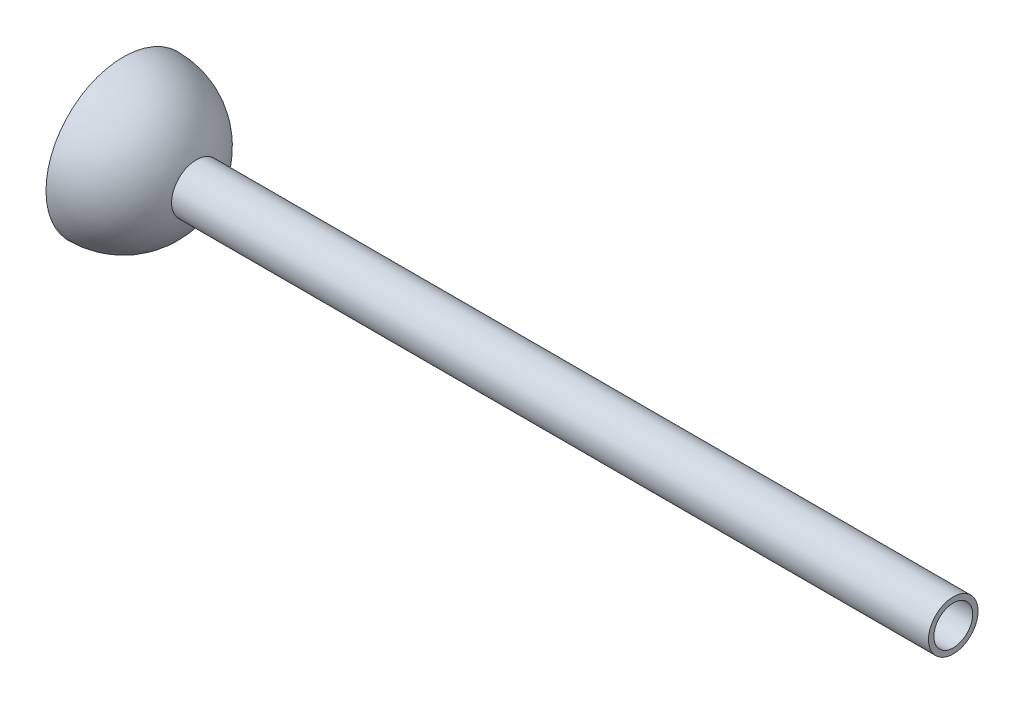
ISO-10303-21;
HEADER;
FILE_DESCRIPTION(('STEP AP214'),'2;1');
FILE_NAME('part.step','',(''),(''),'','','');
FILE_SCHEMA(('AUTOMOTIVE_DESIGN { 1 0 10303 214 1 1 1 1 }'));
ENDSEC;
DATA;
#1=APPLICATION_CONTEXT('core data for automotive mechanical design processes');
#2=APPLICATION_PROTOCOL_DEFINITION('international standard','automotive_design',2000,#1);
#3=PRODUCT_CONTEXT('',#1,'mechanical');
#4=PRODUCT('Part','Part','',(#3));
#5=PRODUCT_RELATED_PRODUCT_CATEGORY('part','',(#4));
#6=PRODUCT_DEFINITION_FORMATION('','',#4);
#7=PRODUCT_DEFINITION_CONTEXT('part definition',#1,'design');
#8=PRODUCT_DEFINITION('design','',#6,#7);
#9=PRODUCT_DEFINITION_SHAPE('','',#8);
#10=(LENGTH_UNIT() NAMED_UNIT(*) SI_UNIT(.MILLI.,.METRE.));
#11=(NAMED_UNIT(*) PLANE_ANGLE_UNIT() SI_UNIT($,.RADIAN.));
#12=(NAMED_UNIT(*) SI_UNIT($,.STERADIAN.) SOLID_ANGLE_UNIT());
#13=UNCERTAINTY_MEASURE_WITH_UNIT(LENGTH_MEASURE(1.E-05),#10,'distance_accuracy_value','');
#14=(GEOMETRIC_REPRESENTATION_CONTEXT(3) GLOBAL_UNCERTAINTY_ASSIGNED_CONTEXT((#13)) GLOBAL_UNIT_ASSIGNED_CONTEXT((#10,
#11,#12)) REPRESENTATION_CONTEXT('',''));
#15=CARTESIAN_POINT('',(0.,0.,0.));
#16=DIRECTION('',(0.,0.,1.));
#17=DIRECTION('',(1.,0.,0.));
#18=AXIS2_PLACEMENT_3D('',#15,#16,#17);
#19=CARTESIAN_POINT('',(0.,0.,0.));
#20=DIRECTION('',(-1.,0.,0.));
#21=DIRECTION('',(0.,0.,-1.));
#22=AXIS2_PLACEMENT_3D('',#19,#20,#21);
#23=SPHERICAL_SURFACE('',#22,10.795);
#24=CARTESIAN_POINT('',(0.,0.,0.));
#25=DIRECTION('',(-1.,0.,0.));
#26=DIRECTION('',(0.,0.,1.));
#27=AXIS2_PLACEMENT_3D('',#24,#25,#26);
#28=CIRCLE('',#27,10.795);
#29=CARTESIAN_POINT('',(0.,0.,10.795));
#30=VERTEX_POINT('',#29);
#31=EDGE_CURVE('E62',#30,#30,#28,.T.);
#32=ORIENTED_EDGE('',*,*,#31,.T.);
#33=EDGE_LOOP('',(#32));
#34=FACE_BOUND('',#33,.T.);
#35=ADVANCED_FACE('F35',(#34),#23,.F.);
#36=CARTESIAN_POINT('',(0.,0.,0.));
#37=DIRECTION('',(-1.,0.,0.));
#38=DIRECTION('',(0.,0.,-1.));
#39=AXIS2_PLACEMENT_3D('',#36,#37,#38);
#40=SPHERICAL_SURFACE('',#39,12.7);
#41=CARTESIAN_POINT('',(12.2919747522557,0.,0.));
#42=DIRECTION('',(-1.,0.,0.));
#43=DIRECTION('',(0.,0.,1.));
#44=AXIS2_PLACEMENT_3D('',#41,#42,#43);
#45=CIRCLE('',#44,3.19333003147328);
#46=CARTESIAN_POINT('',(12.2919747522557,0.,3.19333003147328));
#47=VERTEX_POINT('',#46);
#48=EDGE_CURVE('E10',#47,#47,#45,.T.);
#49=ORIENTED_EDGE('',*,*,#48,.F.);
#50=EDGE_LOOP('',(#49));
#51=FACE_BOUND('',#50,.T.);
#52=ADVANCED_FACE('F93',(#51),#40,.T.);
#53=CARTESIAN_POINT('',(0.,0.,0.));
#54=DIRECTION('',(-1.,0.,0.));
#55=DIRECTION('',(0.,0.,1.));
#56=AXIS2_PLACEMENT_3D('',#53,#54,#55);
#57=CYLINDRICAL_SURFACE('',#56,3.19333003147328);
#58=CARTESIAN_POINT('',(136.525,0.,0.));
#59=DIRECTION('',(-1.,0.,0.));
#60=DIRECTION('',(0.,0.,1.));
#61=AXIS2_PLACEMENT_3D('',#58,#59,#60);
#62=CIRCLE('',#61,3.19333003147328);
#63=CARTESIAN_POINT('',(136.525,0.,3.19333003147328));
#64=VERTEX_POINT('',#63);
#65=EDGE_CURVE('E42',#64,#64,#62,.T.);
#66=ORIENTED_EDGE('',*,*,#65,.F.);
#67=EDGE_LOOP('',(#66));
#68=FACE_BOUND('',#67,.T.);
#69=ORIENTED_EDGE('',*,*,#48,.T.);
#70=EDGE_LOOP('',(#69));
#71=FACE_BOUND('',#70,.T.);
#72=ADVANCED_FACE('F88',(#68,#71),#57,.F.);
#73=CARTESIAN_POINT('',(136.525,0.,-4.0742515347548));
#74=DIRECTION('',(-1.,0.,0.));
#75=DIRECTION('',(0.,0.,1.));
#76=AXIS2_PLACEMENT_3D('',#73,#74,#75);
#77=PLANE('',#76);
#78=CARTESIAN_POINT('',(136.525,0.,0.));
#79=DIRECTION('',(-1.,0.,0.));
#80=DIRECTION('',(0.,0.,1.));
#81=AXIS2_PLACEMENT_3D('',#78,#79,#80);
#82=CIRCLE('',#81,4.0742515347548);
#83=CARTESIAN_POINT('',(136.525,0.,4.0742515347548));
#84=VERTEX_POINT('',#83);
#85=EDGE_CURVE('E47',#84,#84,#82,.T.);
#86=ORIENTED_EDGE('',*,*,#85,.F.);
#87=EDGE_LOOP('',(#86));
#88=FACE_BOUND('',#87,.T.);
#89=ORIENTED_EDGE('',*,*,#65,.T.);
#90=EDGE_LOOP('',(#89));
#91=FACE_BOUND('',#90,.T.);
#92=ADVANCED_FACE('F83',(#88,#91),#77,.F.);
#93=CARTESIAN_POINT('',(0.,0.,0.));
#94=DIRECTION('',(-1.,0.,0.));
#95=DIRECTION('',(0.,0.,1.));
#96=AXIS2_PLACEMENT_3D('',#93,#94,#95);
#97=CYLINDRICAL_SURFACE('',#96,4.0742515347548);
#98=CARTESIAN_POINT('',(12.028735362936,0.,0.));
#99=DIRECTION('',(-1.,0.,0.));
#100=DIRECTION('',(0.,0.,1.));
#101=AXIS2_PLACEMENT_3D('',#98,#99,#100);
#102=CIRCLE('',#101,4.0742515347548);
#103=CARTESIAN_POINT('',(12.028735362936,0.,4.0742515347548));
#104=VERTEX_POINT('',#103);
#105=EDGE_CURVE('E52',#104,#104,#102,.T.);
#106=ORIENTED_EDGE('',*,*,#105,.F.);
#107=EDGE_LOOP('',(#106));
#108=FACE_BOUND('',#107,.T.);
#109=ORIENTED_EDGE('',*,*,#85,.T.);
#110=EDGE_LOOP('',(#109));
#111=FACE_BOUND('',#110,.T.);
#112=ADVANCED_FACE('F77',(#108,#111),#97,.T.);
#113=CARTESIAN_POINT('',(0.,0.,0.));
#114=DIRECTION('',(-1.,0.,0.));
#115=DIRECTION('',(0.,0.,-1.));
#116=AXIS2_PLACEMENT_3D('',#113,#114,#115);
#117=SPHERICAL_SURFACE('',#116,12.7);
#118=CARTESIAN_POINT('',(0.,0.,0.));
#119=DIRECTION('',(-1.,0.,0.));
#120=DIRECTION('',(0.,0.,1.));
#121=AXIS2_PLACEMENT_3D('',#118,#119,#120);
#122=CIRCLE('',#121,12.7);
#123=CARTESIAN_POINT('',(0.,0.,12.7));
#124=VERTEX_POINT('',#123);
#125=EDGE_CURVE('E58',#124,#124,#122,.T.);
#126=ORIENTED_EDGE('',*,*,#125,.F.);
#127=EDGE_LOOP('',(#126));
#128=FACE_BOUND('',#127,.T.);
#129=ORIENTED_EDGE('',*,*,#105,.T.);
#130=EDGE_LOOP('',(#129));
#131=FACE_BOUND('',#130,.T.);
#132=ADVANCED_FACE('F71',(#128,#131),#117,.T.);
#133=CARTESIAN_POINT('',(0.,0.,-12.7));
#134=DIRECTION('',(1.,0.,0.));
#135=DIRECTION('',(0.,0.,-1.));
#136=AXIS2_PLACEMENT_3D('',#133,#134,#135);
#137=PLANE('',#136);
#138=ORIENTED_EDGE('',*,*,#31,.F.);
#139=EDGE_LOOP('',(#138));
#140=FACE_BOUND('',#139,.T.);
#141=ORIENTED_EDGE('',*,*,#125,.T.);
#142=EDGE_LOOP('',(#141));
#143=FACE_BOUND('',#142,.T.);
#144=ADVANCED_FACE('F68',(#140,#143),#137,.F.);
#145=CLOSED_SHELL('',(#35,#52,#72,#92,#112,#132,#144));
#146=MANIFOLD_SOLID_BREP('B2',#145);
#147=ADVANCED_BREP_SHAPE_REPRESENTATION('',(#18,#146),#14);
#148=SHAPE_DEFINITION_REPRESENTATION(#9,#147);
ENDSEC;
END-ISO-10303-21;
